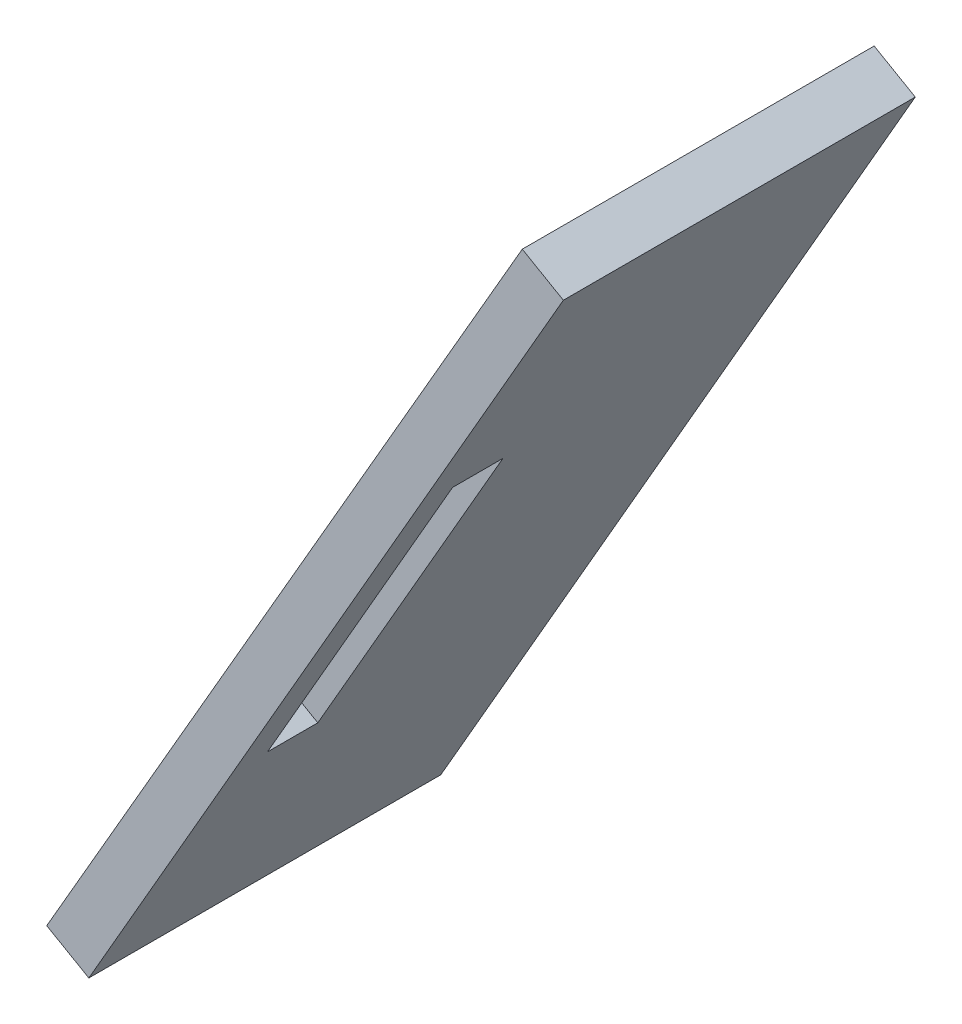
ISO-10303-21;
HEADER;
FILE_DESCRIPTION(('STEP AP214'),'2;1');
FILE_NAME('part.step','',(''),(''),'','','');
FILE_SCHEMA(('AUTOMOTIVE_DESIGN { 1 0 10303 214 1 1 1 1 }'));
ENDSEC;
DATA;
#1=APPLICATION_CONTEXT('core data for automotive mechanical design processes');
#2=APPLICATION_PROTOCOL_DEFINITION('international standard','automotive_design',2000,#1);
#3=PRODUCT_CONTEXT('',#1,'mechanical');
#4=PRODUCT('Part','Part','',(#3));
#5=PRODUCT_RELATED_PRODUCT_CATEGORY('part','',(#4));
#6=PRODUCT_DEFINITION_FORMATION('','',#4);
#7=PRODUCT_DEFINITION_CONTEXT('part definition',#1,'design');
#8=PRODUCT_DEFINITION('design','',#6,#7);
#9=PRODUCT_DEFINITION_SHAPE('','',#8);
#10=(LENGTH_UNIT() NAMED_UNIT(*) SI_UNIT(.MILLI.,.METRE.));
#11=(NAMED_UNIT(*) PLANE_ANGLE_UNIT() SI_UNIT($,.RADIAN.));
#12=(NAMED_UNIT(*) SI_UNIT($,.STERADIAN.) SOLID_ANGLE_UNIT());
#13=UNCERTAINTY_MEASURE_WITH_UNIT(LENGTH_MEASURE(1.E-05),#10,'distance_accuracy_value','');
#14=(GEOMETRIC_REPRESENTATION_CONTEXT(3) GLOBAL_UNCERTAINTY_ASSIGNED_CONTEXT((#13)) GLOBAL_UNIT_ASSIGNED_CONTEXT((#10,
#11,#12)) REPRESENTATION_CONTEXT('',''));
#15=CARTESIAN_POINT('',(0.,0.,0.));
#16=DIRECTION('',(0.,0.,1.));
#17=DIRECTION('',(1.,0.,0.));
#18=AXIS2_PLACEMENT_3D('',#15,#16,#17);
#19=CARTESIAN_POINT('',(0.,0.,0.));
#20=DIRECTION('',(0.,0.,1.));
#21=DIRECTION('',(1.,0.,0.));
#22=AXIS2_PLACEMENT_3D('',#19,#20,#21);
#23=PLANE('',#22);
#24=DIRECTION('',(-0.50000000029189,-0.866025403615916,0.));
#25=VECTOR('',#24,1.);
#26=CARTESIAN_POINT('',(100.,-3.37049385377106E-08,0.));
#27=LINE('',#26,#25);
#28=CARTESIAN_POINT('',(100.,-3.37049385377106E-08,0.));
#29=VERTEX_POINT('',#28);
#30=CARTESIAN_POINT('',(49.9999999708112,-86.6025403952965,0.));
#31=VERTEX_POINT('',#30);
#32=EDGE_CURVE('E123',#29,#31,#27,.T.);
#33=ORIENTED_EDGE('',*,*,#32,.F.);
#34=DIRECTION('',(-0.86664826945569,0.498919609806487,0.));
#35=VECTOR('',#34,1.);
#36=CARTESIAN_POINT('',(104.320933147144,-2.48751239108462,0.));
#37=LINE('',#36,#35);
#38=CARTESIAN_POINT('',(104.320933147144,-2.48751239108462,0.));
#39=VERTEX_POINT('',#38);
#40=EDGE_CURVE('E145',#39,#29,#37,.T.);
#41=ORIENTED_EDGE('',*,*,#40,.F.);
#42=DIRECTION('',(0.498932798431795,0.866640676779608,0.));
#43=VECTOR('',#42,1.);
#44=CARTESIAN_POINT('',(54.4276533039641,-89.1515800690455,0.));
#45=LINE('',#44,#43);
#46=CARTESIAN_POINT('',(54.4276533039641,-89.1515800690455,0.));
#47=VERTEX_POINT('',#46);
#48=EDGE_CURVE('E142',#47,#39,#45,.T.);
#49=ORIENTED_EDGE('',*,*,#48,.F.);
#50=DIRECTION('',(0.866640676779608,-0.498932798431796,0.));
#51=VECTOR('',#50,1.);
#52=CARTESIAN_POINT('',(49.9999999708112,-86.6025403952965,0.));
#53=LINE('',#52,#51);
#54=EDGE_CURVE('E139',#31,#47,#53,.T.);
#55=ORIENTED_EDGE('',*,*,#54,.F.);
#56=EDGE_LOOP('',(#33,#41,#49,#55));
#57=FACE_BOUND('',#56,.T.);
#58=ADVANCED_FACE('F32',(#57),#23,.F.);
#59=CARTESIAN_POINT('',(104.320933147144,-2.48751239108462,141.397164731353));
#60=DIRECTION('',(-0.498919609806487,-0.86664826945569,0.));
#61=DIRECTION('',(0.866648269455691,-0.498919609806487,0.));
#62=AXIS2_PLACEMENT_3D('',#59,#60,#61);
#63=PLANE('',#62);
#64=DIRECTION('',(0.,0.,-1.));
#65=VECTOR('',#64,1.);
#66=CARTESIAN_POINT('',(100.,-3.37049385377106E-08,141.397164731353));
#67=LINE('',#66,#65);
#68=CARTESIAN_POINT('',(100.,-3.37049377123477E-08,37.));
#69=VERTEX_POINT('',#68);
#70=EDGE_CURVE('E148',#69,#29,#67,.T.);
#71=ORIENTED_EDGE('',*,*,#70,.F.);
#72=DIRECTION('',(0.866648269455691,-0.498919609806487,0.));
#73=VECTOR('',#72,1.);
#74=CARTESIAN_POINT('',(104.320933147144,-2.48751239108462,37.));
#75=LINE('',#74,#73);
#76=CARTESIAN_POINT('',(104.320933147144,-2.48751239108462,37.));
#77=VERTEX_POINT('',#76);
#78=EDGE_CURVE('E130',#69,#77,#75,.T.);
#79=ORIENTED_EDGE('',*,*,#78,.T.);
#80=DIRECTION('',(0.,0.,-1.));
#81=VECTOR('',#80,1.);
#82=CARTESIAN_POINT('',(104.320933147144,-2.48751239108462,141.397164731353));
#83=LINE('',#82,#81);
#84=EDGE_CURVE('E150',#77,#39,#83,.T.);
#85=ORIENTED_EDGE('',*,*,#84,.T.);
#86=ORIENTED_EDGE('',*,*,#40,.T.);
#87=EDGE_LOOP('',(#71,#79,#85,#86));
#88=FACE_BOUND('',#87,.T.);
#89=ADVANCED_FACE('F178',(#88),#63,.F.);
#90=CARTESIAN_POINT('',(54.4276533039641,-89.1515800690455,141.397164731353));
#91=DIRECTION('',(-0.866640676779608,0.498932798431795,0.));
#92=DIRECTION('',(-0.498932798431795,-0.866640676779608,0.));
#93=AXIS2_PLACEMENT_3D('',#90,#91,#92);
#94=PLANE('',#93);
#95=DIRECTION('',(0.,0.,-1.));
#96=VECTOR('',#95,1.);
#97=CARTESIAN_POINT('',(69.6258552463589,-62.752473699231,0.));
#98=LINE('',#97,#96);
#99=CARTESIAN_POINT('',(69.6258552463589,-62.752473699231,33.4244095305818));
#100=VERTEX_POINT('',#99);
#101=CARTESIAN_POINT('',(69.6258552463589,-62.752473699231,28.1244095305818));
#102=VERTEX_POINT('',#101);
#103=EDGE_CURVE('E109',#100,#102,#98,.T.);
#104=ORIENTED_EDGE('',*,*,#103,.F.);
#105=DIRECTION('',(-0.498932798431795,-0.866640676779608,0.));
#106=VECTOR('',#105,1.);
#107=CARTESIAN_POINT('',(79.4275015705702,-45.7271239313503,33.4244095305818));
#108=LINE('',#107,#106);
#109=CARTESIAN_POINT('',(89.0932652120322,-28.9378008598717,33.4244095305818));
#110=VERTEX_POINT('',#109);
#111=EDGE_CURVE('E47',#110,#100,#108,.T.);
#112=ORIENTED_EDGE('',*,*,#111,.F.);
#113=DIRECTION('',(0.,0.,-1.));
#114=VECTOR('',#113,1.);
#115=CARTESIAN_POINT('',(89.0932652120322,-28.9378008598717,0.));
#116=LINE('',#115,#114);
#117=CARTESIAN_POINT('',(89.0932652120322,-28.9378008598717,28.1244095305818));
#118=VERTEX_POINT('',#117);
#119=EDGE_CURVE('E116',#110,#118,#116,.T.);
#120=ORIENTED_EDGE('',*,*,#119,.T.);
#121=DIRECTION('',(0.498932798431795,0.866640676779608,0.));
#122=VECTOR('',#121,1.);
#123=CARTESIAN_POINT('',(79.4275015705702,-45.7271239313503,28.1244095305818));
#124=LINE('',#123,#122);
#125=EDGE_CURVE('E100',#102,#118,#124,.T.);
#126=ORIENTED_EDGE('',*,*,#125,.F.);
#127=EDGE_LOOP('',(#104,#112,#120,#126));
#128=FACE_BOUND('',#127,.T.);
#129=ORIENTED_EDGE('',*,*,#84,.F.);
#130=DIRECTION('',(-0.498932798431795,-0.866640676779608,0.));
#131=VECTOR('',#130,1.);
#132=CARTESIAN_POINT('',(54.4276533039641,-89.1515800690455,37.));
#133=LINE('',#132,#131);
#134=CARTESIAN_POINT('',(54.4276533039641,-89.1515800690455,37.));
#135=VERTEX_POINT('',#134);
#136=EDGE_CURVE('E126',#77,#135,#133,.T.);
#137=ORIENTED_EDGE('',*,*,#136,.T.);
#138=DIRECTION('',(0.,0.,-1.));
#139=VECTOR('',#138,1.);
#140=CARTESIAN_POINT('',(54.4276533039641,-89.1515800690455,141.397164731353));
#141=LINE('',#140,#139);
#142=EDGE_CURVE('E152',#135,#47,#141,.T.);
#143=ORIENTED_EDGE('',*,*,#142,.T.);
#144=ORIENTED_EDGE('',*,*,#48,.T.);
#145=EDGE_LOOP('',(#129,#137,#143,#144));
#146=FACE_BOUND('',#145,.T.);
#147=ADVANCED_FACE('F113',(#128,#146),#94,.F.);
#148=CARTESIAN_POINT('',(49.9999999708112,-86.6025403952965,141.397164731353));
#149=DIRECTION('',(0.498932798431796,0.866640676779608,0.));
#150=DIRECTION('',(-0.866640676779608,0.498932798431796,0.));
#151=AXIS2_PLACEMENT_3D('',#148,#149,#150);
#152=PLANE('',#151);
#153=ORIENTED_EDGE('',*,*,#142,.F.);
#154=DIRECTION('',(-0.866640676779608,0.498932798431796,0.));
#155=VECTOR('',#154,1.);
#156=CARTESIAN_POINT('',(49.9999999708112,-86.6025403952965,37.));
#157=LINE('',#156,#155);
#158=CARTESIAN_POINT('',(49.9999999708112,-86.6025403952965,37.));
#159=VERTEX_POINT('',#158);
#160=EDGE_CURVE('E129',#135,#159,#157,.T.);
#161=ORIENTED_EDGE('',*,*,#160,.T.);
#162=DIRECTION('',(0.,0.,-1.));
#163=VECTOR('',#162,1.);
#164=CARTESIAN_POINT('',(49.9999999708112,-86.6025403952965,141.397164731353));
#165=LINE('',#164,#163);
#166=EDGE_CURVE('E154',#159,#31,#165,.T.);
#167=ORIENTED_EDGE('',*,*,#166,.T.);
#168=ORIENTED_EDGE('',*,*,#54,.T.);
#169=EDGE_LOOP('',(#153,#161,#167,#168));
#170=FACE_BOUND('',#169,.T.);
#171=ADVANCED_FACE('F189',(#170),#152,.F.);
#172=CARTESIAN_POINT('',(100.,-3.37049385377106E-08,141.397164731353));
#173=DIRECTION('',(0.866025403615916,-0.50000000029189,0.));
#174=DIRECTION('',(0.50000000029189,0.866025403615916,0.));
#175=AXIS2_PLACEMENT_3D('',#172,#173,#174);
#176=PLANE('',#175);
#177=DIRECTION('',(0.,0.,-1.));
#178=VECTOR('',#177,1.);
#179=CARTESIAN_POINT('',(84.7397869115423,-26.4314644166679,141.397164731353));
#180=LINE('',#179,#178);
#181=CARTESIAN_POINT('',(84.7397869115423,-26.4314644166679,33.4244095305818));
#182=VERTEX_POINT('',#181);
#183=CARTESIAN_POINT('',(84.7397869115423,-26.4314644166679,28.1244095305818));
#184=VERTEX_POINT('',#183);
#185=EDGE_CURVE('E40',#182,#184,#180,.T.);
#186=ORIENTED_EDGE('',*,*,#185,.F.);
#187=DIRECTION('',(-0.50000000029189,-0.866025403615916,0.));
#188=VECTOR('',#187,1.);
#189=CARTESIAN_POINT('',(100.,-3.37049385377106E-08,33.4244095305818));
#190=LINE('',#189,#188);
#191=CARTESIAN_POINT('',(65.2307219543489,-60.2221561043866,33.4244095305818));
#192=VERTEX_POINT('',#191);
#193=EDGE_CURVE('E11',#182,#192,#190,.T.);
#194=ORIENTED_EDGE('',*,*,#193,.T.);
#195=DIRECTION('',(0.,0.,-1.));
#196=VECTOR('',#195,1.);
#197=CARTESIAN_POINT('',(65.2307219543489,-60.2221561043866,141.397164731353));
#198=LINE('',#197,#196);
#199=CARTESIAN_POINT('',(65.2307219543489,-60.2221561043866,28.1244095305818));
#200=VERTEX_POINT('',#199);
#201=EDGE_CURVE('E136',#192,#200,#198,.T.);
#202=ORIENTED_EDGE('',*,*,#201,.T.);
#203=DIRECTION('',(0.50000000029189,0.866025403615916,0.));
#204=VECTOR('',#203,1.);
#205=CARTESIAN_POINT('',(100.,-3.37049298150315E-08,28.1244095305818));
#206=LINE('',#205,#204);
#207=EDGE_CURVE('E103',#200,#184,#206,.T.);
#208=ORIENTED_EDGE('',*,*,#207,.T.);
#209=EDGE_LOOP('',(#186,#194,#202,#208));
#210=FACE_BOUND('',#209,.T.);
#211=ORIENTED_EDGE('',*,*,#166,.F.);
#212=DIRECTION('',(0.50000000029189,0.866025403615916,0.));
#213=VECTOR('',#212,1.);
#214=CARTESIAN_POINT('',(100.,-3.37049385377106E-08,37.));
#215=LINE('',#214,#213);
#216=EDGE_CURVE('E133',#159,#69,#215,.T.);
#217=ORIENTED_EDGE('',*,*,#216,.T.);
#218=ORIENTED_EDGE('',*,*,#70,.T.);
#219=ORIENTED_EDGE('',*,*,#32,.T.);
#220=EDGE_LOOP('',(#211,#217,#218,#219));
#221=FACE_BOUND('',#220,.T.);
#222=ADVANCED_FACE('F34',(#210,#221),#176,.F.);
#223=CARTESIAN_POINT('',(-47.0621948770456,-96.0356885206761,37.));
#224=DIRECTION('',(0.,0.,-1.));
#225=DIRECTION('',(0.866503571633321,-0.499170872894942,0.));
#226=AXIS2_PLACEMENT_3D('',#223,#224,#225);
#227=PLANE('',#226);
#228=ORIENTED_EDGE('',*,*,#160,.F.);
#229=ORIENTED_EDGE('',*,*,#136,.F.);
#230=ORIENTED_EDGE('',*,*,#78,.F.);
#231=ORIENTED_EDGE('',*,*,#216,.F.);
#232=EDGE_LOOP('',(#228,#229,#230,#231));
#233=FACE_BOUND('',#232,.T.);
#234=ADVANCED_FACE('F167',(#233),#227,.F.);
#235=CARTESIAN_POINT('',(70.7610948027741,-40.7377959470323,33.4244095305818));
#236=DIRECTION('',(0.,0.,1.));
#237=DIRECTION('',(1.,0.,0.));
#238=AXIS2_PLACEMENT_3D('',#235,#236,#237);
#239=PLANE('',#238);
#240=DIRECTION('',(0.866640676779608,-0.498932798431795,0.));
#241=VECTOR('',#240,1.);
#242=CARTESIAN_POINT('',(80.4268584442361,-23.9484728755537,33.4244095305818));
#243=LINE('',#242,#241);
#244=EDGE_CURVE('E121',#182,#110,#243,.T.);
#245=ORIENTED_EDGE('',*,*,#244,.T.);
#246=ORIENTED_EDGE('',*,*,#111,.T.);
#247=DIRECTION('',(0.866640676779608,-0.498932798431795,0.));
#248=VECTOR('',#247,1.);
#249=CARTESIAN_POINT('',(60.9594484785628,-57.7631457149131,33.4244095305818));
#250=LINE('',#249,#248);
#251=EDGE_CURVE('E106',#192,#100,#250,.T.);
#252=ORIENTED_EDGE('',*,*,#251,.F.);
#253=ORIENTED_EDGE('',*,*,#193,.F.);
#254=EDGE_LOOP('',(#245,#246,#252,#253));
#255=FACE_BOUND('',#254,.T.);
#256=ADVANCED_FACE('F165',(#255),#239,.F.);
#257=CARTESIAN_POINT('',(80.4268584442361,-23.9484728755537,0.));
#258=DIRECTION('',(-0.498932798431795,-0.866640676779608,0.));
#259=DIRECTION('',(0.866640676779608,-0.498932798431795,0.));
#260=AXIS2_PLACEMENT_3D('',#257,#258,#259);
#261=PLANE('',#260);
#262=ORIENTED_EDGE('',*,*,#185,.T.);
#263=DIRECTION('',(0.866640676779608,-0.498932798431795,0.));
#264=VECTOR('',#263,1.);
#265=CARTESIAN_POINT('',(80.4268584442361,-23.9484728755537,28.1244095305818));
#266=LINE('',#265,#264);
#267=EDGE_CURVE('E105',#184,#118,#266,.T.);
#268=ORIENTED_EDGE('',*,*,#267,.T.);
#269=ORIENTED_EDGE('',*,*,#119,.F.);
#270=ORIENTED_EDGE('',*,*,#244,.F.);
#271=EDGE_LOOP('',(#262,#268,#269,#270));
#272=FACE_BOUND('',#271,.T.);
#273=ADVANCED_FACE('F162',(#272),#261,.T.);
#274=CARTESIAN_POINT('',(70.7610948027741,-40.7377959470323,28.1244095305818));
#275=DIRECTION('',(0.,0.,-1.));
#276=DIRECTION('',(0.,1.,0.));
#277=AXIS2_PLACEMENT_3D('',#274,#275,#276);
#278=PLANE('',#277);
#279=DIRECTION('',(0.866640676779608,-0.498932798431795,0.));
#280=VECTOR('',#279,1.);
#281=CARTESIAN_POINT('',(60.9594484785628,-57.7631457149131,28.1244095305818));
#282=LINE('',#281,#280);
#283=EDGE_CURVE('E55',#200,#102,#282,.T.);
#284=ORIENTED_EDGE('',*,*,#283,.T.);
#285=ORIENTED_EDGE('',*,*,#125,.T.);
#286=ORIENTED_EDGE('',*,*,#267,.F.);
#287=ORIENTED_EDGE('',*,*,#207,.F.);
#288=EDGE_LOOP('',(#284,#285,#286,#287));
#289=FACE_BOUND('',#288,.T.);
#290=ADVANCED_FACE('F97',(#289),#278,.F.);
#291=CARTESIAN_POINT('',(60.9594484785628,-57.7631457149131,0.));
#292=DIRECTION('',(-0.498932798431795,-0.866640676779608,0.));
#293=DIRECTION('',(0.866640676779608,-0.498932798431795,0.));
#294=AXIS2_PLACEMENT_3D('',#291,#292,#293);
#295=PLANE('',#294);
#296=ORIENTED_EDGE('',*,*,#251,.T.);
#297=ORIENTED_EDGE('',*,*,#103,.T.);
#298=ORIENTED_EDGE('',*,*,#283,.F.);
#299=ORIENTED_EDGE('',*,*,#201,.F.);
#300=EDGE_LOOP('',(#296,#297,#298,#299));
#301=FACE_BOUND('',#300,.T.);
#302=ADVANCED_FACE('F110',(#301),#295,.F.);
#303=CLOSED_SHELL('',(#58,#89,#147,#171,#222,#234,#256,#273,#290,#302));
#304=MANIFOLD_SOLID_BREP('B2',#303);
#305=ADVANCED_BREP_SHAPE_REPRESENTATION('',(#18,#304),#14);
#306=SHAPE_DEFINITION_REPRESENTATION(#9,#305);
ENDSEC;
END-ISO-10303-21;
